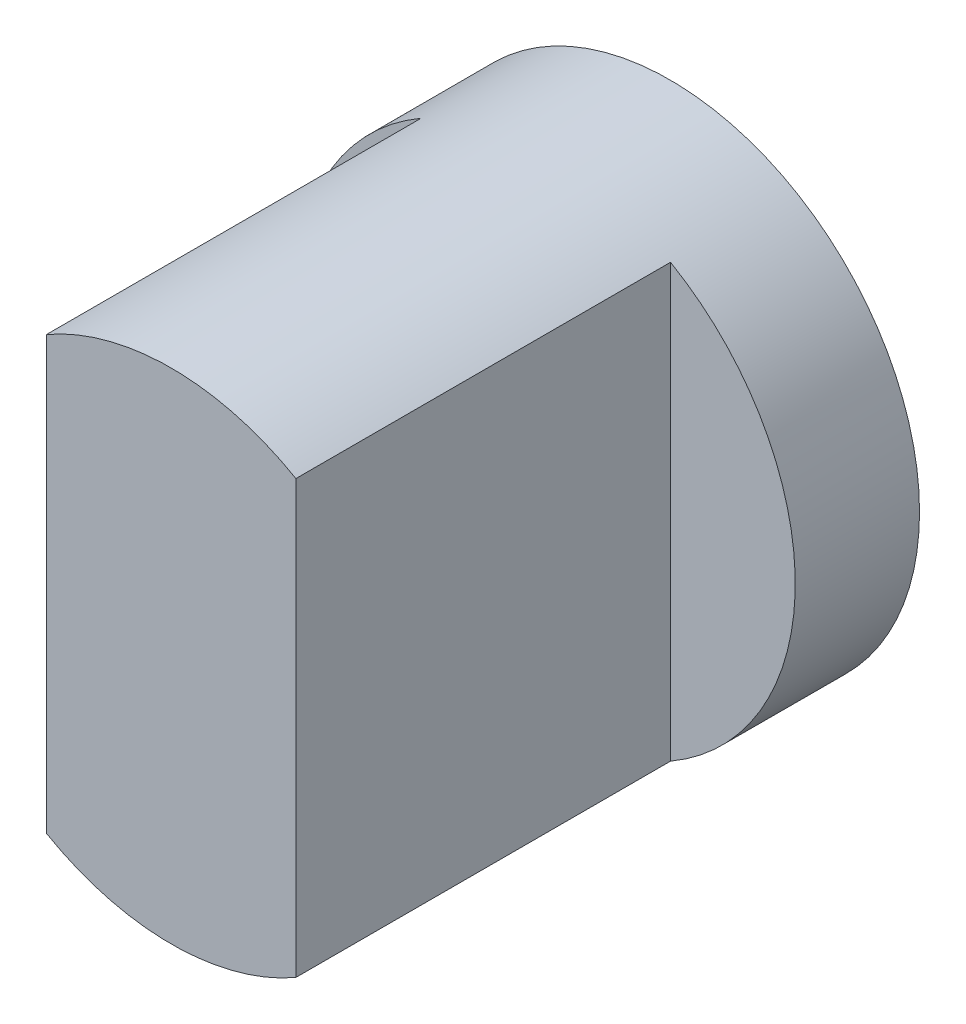
ISO-10303-21;
HEADER;
FILE_DESCRIPTION(('STEP AP214'),'2;1');
FILE_NAME('part.step','',(''),(''),'','','');
FILE_SCHEMA(('AUTOMOTIVE_DESIGN { 1 0 10303 214 1 1 1 1 }'));
ENDSEC;
DATA;
#1=APPLICATION_CONTEXT('core data for automotive mechanical design processes');
#2=APPLICATION_PROTOCOL_DEFINITION('international standard','automotive_design',2000,#1);
#3=PRODUCT_CONTEXT('',#1,'mechanical');
#4=PRODUCT('Part','Part','',(#3));
#5=PRODUCT_RELATED_PRODUCT_CATEGORY('part','',(#4));
#6=PRODUCT_DEFINITION_FORMATION('','',#4);
#7=PRODUCT_DEFINITION_CONTEXT('part definition',#1,'design');
#8=PRODUCT_DEFINITION('design','',#6,#7);
#9=PRODUCT_DEFINITION_SHAPE('','',#8);
#10=(LENGTH_UNIT() NAMED_UNIT(*) SI_UNIT(.MILLI.,.METRE.));
#11=(NAMED_UNIT(*) PLANE_ANGLE_UNIT() SI_UNIT($,.RADIAN.));
#12=(NAMED_UNIT(*) SI_UNIT($,.STERADIAN.) SOLID_ANGLE_UNIT());
#13=UNCERTAINTY_MEASURE_WITH_UNIT(LENGTH_MEASURE(1.E-05),#10,'distance_accuracy_value','');
#14=(GEOMETRIC_REPRESENTATION_CONTEXT(3) GLOBAL_UNCERTAINTY_ASSIGNED_CONTEXT((#13)) GLOBAL_UNIT_ASSIGNED_CONTEXT((#10,
#11,#12)) REPRESENTATION_CONTEXT('',''));
#15=CARTESIAN_POINT('',(0.,0.,0.));
#16=DIRECTION('',(0.,0.,1.));
#17=DIRECTION('',(1.,0.,0.));
#18=AXIS2_PLACEMENT_3D('',#15,#16,#17);
#19=CARTESIAN_POINT('',(0.,0.,4.));
#20=DIRECTION('',(0.,0.,-1.));
#21=DIRECTION('',(-1.,0.,0.));
#22=AXIS2_PLACEMENT_3D('',#19,#20,#21);
#23=CYLINDRICAL_SURFACE('',#22,2.);
#24=CARTESIAN_POINT('',(0.,0.,4.));
#25=DIRECTION('',(0.,0.,1.));
#26=DIRECTION('',(1.,0.,0.));
#27=AXIS2_PLACEMENT_3D('',#24,#25,#26);
#28=CIRCLE('',#27,2.);
#29=CARTESIAN_POINT('',(1.,1.73205080756888,4.));
#30=VERTEX_POINT('',#29);
#31=CARTESIAN_POINT('',(-1.,1.73205080756888,4.));
#32=VERTEX_POINT('',#31);
#33=EDGE_CURVE('E76',#30,#32,#28,.T.);
#34=ORIENTED_EDGE('',*,*,#33,.F.);
#35=DIRECTION('',(0.,0.,-1.));
#36=VECTOR('',#35,1.);
#37=CARTESIAN_POINT('',(1.,1.73205080756888,4.));
#38=LINE('',#37,#36);
#39=CARTESIAN_POINT('',(1.,1.73205080756888,0.996424706562642));
#40=VERTEX_POINT('',#39);
#41=EDGE_CURVE('E55',#30,#40,#38,.T.);
#42=ORIENTED_EDGE('',*,*,#41,.T.);
#43=CARTESIAN_POINT('',(0.,0.,0.996424706562642));
#44=DIRECTION('',(0.,0.,-1.));
#45=DIRECTION('',(-1.,0.,0.));
#46=AXIS2_PLACEMENT_3D('',#43,#44,#45);
#47=CIRCLE('',#46,2.);
#48=CARTESIAN_POINT('',(1.,-1.73205080756888,0.996424706562642));
#49=VERTEX_POINT('',#48);
#50=EDGE_CURVE('E11',#40,#49,#47,.T.);
#51=ORIENTED_EDGE('',*,*,#50,.T.);
#52=DIRECTION('',(0.,0.,-1.));
#53=VECTOR('',#52,1.);
#54=CARTESIAN_POINT('',(1.,-1.73205080756888,4.));
#55=LINE('',#54,#53);
#56=CARTESIAN_POINT('',(1.,-1.73205080756888,4.));
#57=VERTEX_POINT('',#56);
#58=EDGE_CURVE('E93',#49,#57,#55,.F.);
#59=ORIENTED_EDGE('',*,*,#58,.T.);
#60=CARTESIAN_POINT('',(-1.,-1.73205080756888,4.));
#61=VERTEX_POINT('',#60);
#62=EDGE_CURVE('E83',#61,#57,#28,.T.);
#63=ORIENTED_EDGE('',*,*,#62,.F.);
#64=DIRECTION('',(0.,0.,-1.));
#65=VECTOR('',#64,1.);
#66=CARTESIAN_POINT('',(-1.,-1.73205080756888,4.));
#67=LINE('',#66,#65);
#68=CARTESIAN_POINT('',(-1.,-1.73205080756888,0.996424706562642));
#69=VERTEX_POINT('',#68);
#70=EDGE_CURVE('E47',#61,#69,#67,.T.);
#71=ORIENTED_EDGE('',*,*,#70,.T.);
#72=CARTESIAN_POINT('',(0.,0.,0.996424706562642));
#73=DIRECTION('',(0.,0.,-1.));
#74=DIRECTION('',(-1.,0.,0.));
#75=AXIS2_PLACEMENT_3D('',#72,#73,#74);
#76=CIRCLE('',#75,2.);
#77=CARTESIAN_POINT('',(-1.,1.73205080756888,0.996424706562642));
#78=VERTEX_POINT('',#77);
#79=EDGE_CURVE('E40',#69,#78,#76,.T.);
#80=ORIENTED_EDGE('',*,*,#79,.T.);
#81=DIRECTION('',(0.,0.,-1.));
#82=VECTOR('',#81,1.);
#83=CARTESIAN_POINT('',(-1.,1.73205080756888,4.));
#84=LINE('',#83,#82);
#85=EDGE_CURVE('E86',#78,#32,#84,.F.);
#86=ORIENTED_EDGE('',*,*,#85,.T.);
#87=EDGE_LOOP('',(#34,#42,#51,#59,#63,#71,#80,#86));
#88=FACE_BOUND('',#87,.T.);
#89=CARTESIAN_POINT('',(0.,0.,0.));
#90=DIRECTION('',(0.,0.,1.));
#91=DIRECTION('',(1.,0.,0.));
#92=AXIS2_PLACEMENT_3D('',#89,#90,#91);
#93=CIRCLE('',#92,2.);
#94=CARTESIAN_POINT('',(2.,0.,0.));
#95=VERTEX_POINT('',#94);
#96=EDGE_CURVE('E101',#95,#95,#93,.T.);
#97=ORIENTED_EDGE('',*,*,#96,.T.);
#98=EDGE_LOOP('',(#97));
#99=FACE_BOUND('',#98,.T.);
#100=ADVANCED_FACE('F33',(#88,#99),#23,.T.);
#101=CARTESIAN_POINT('',(0.,0.,4.));
#102=DIRECTION('',(0.,0.,1.));
#103=DIRECTION('',(1.,0.,0.));
#104=AXIS2_PLACEMENT_3D('',#101,#102,#103);
#105=PLANE('',#104);
#106=DIRECTION('',(0.,-1.,0.));
#107=VECTOR('',#106,1.);
#108=CARTESIAN_POINT('',(1.,0.,4.));
#109=LINE('',#108,#107);
#110=EDGE_CURVE('E80',#30,#57,#109,.T.);
#111=ORIENTED_EDGE('',*,*,#110,.F.);
#112=ORIENTED_EDGE('',*,*,#33,.T.);
#113=DIRECTION('',(0.,1.,0.));
#114=VECTOR('',#113,1.);
#115=CARTESIAN_POINT('',(-1.,0.,4.));
#116=LINE('',#115,#114);
#117=EDGE_CURVE('E78',#61,#32,#116,.T.);
#118=ORIENTED_EDGE('',*,*,#117,.F.);
#119=ORIENTED_EDGE('',*,*,#62,.T.);
#120=EDGE_LOOP('',(#111,#112,#118,#119));
#121=FACE_BOUND('',#120,.T.);
#122=ADVANCED_FACE('F77',(#121),#105,.T.);
#123=CARTESIAN_POINT('',(0.,0.,0.));
#124=DIRECTION('',(0.,0.,1.));
#125=DIRECTION('',(1.,0.,0.));
#126=AXIS2_PLACEMENT_3D('',#123,#124,#125);
#127=PLANE('',#126);
#128=ORIENTED_EDGE('',*,*,#96,.F.);
#129=EDGE_LOOP('',(#128));
#130=FACE_BOUND('',#129,.T.);
#131=ADVANCED_FACE('F123',(#130),#127,.F.);
#132=CARTESIAN_POINT('',(-1.,-2.,3.));
#133=DIRECTION('',(1.,0.,0.));
#134=DIRECTION('',(0.,0.,-1.));
#135=AXIS2_PLACEMENT_3D('',#132,#133,#134);
#136=PLANE('',#135);
#137=ORIENTED_EDGE('',*,*,#117,.T.);
#138=ORIENTED_EDGE('',*,*,#85,.F.);
#139=DIRECTION('',(0.,1.,0.));
#140=VECTOR('',#139,1.);
#141=CARTESIAN_POINT('',(-1.,-2.,0.996424706562642));
#142=LINE('',#141,#140);
#143=EDGE_CURVE('E95',#69,#78,#142,.T.);
#144=ORIENTED_EDGE('',*,*,#143,.F.);
#145=ORIENTED_EDGE('',*,*,#70,.F.);
#146=EDGE_LOOP('',(#137,#138,#144,#145));
#147=FACE_BOUND('',#146,.T.);
#148=ADVANCED_FACE('F85',(#147),#136,.F.);
#149=CARTESIAN_POINT('',(-1.,-2.,0.996424706562642));
#150=DIRECTION('',(0.,0.,-1.));
#151=DIRECTION('',(-1.,0.,0.));
#152=AXIS2_PLACEMENT_3D('',#149,#150,#151);
#153=PLANE('',#152);
#154=ORIENTED_EDGE('',*,*,#79,.F.);
#155=ORIENTED_EDGE('',*,*,#143,.T.);
#156=EDGE_LOOP('',(#154,#155));
#157=FACE_BOUND('',#156,.T.);
#158=ADVANCED_FACE('F110',(#157),#153,.F.);
#159=CARTESIAN_POINT('',(1.,-2.,0.996424706562642));
#160=DIRECTION('',(0.,0.,-1.));
#161=DIRECTION('',(-1.,0.,0.));
#162=AXIS2_PLACEMENT_3D('',#159,#160,#161);
#163=PLANE('',#162);
#164=DIRECTION('',(0.,1.,0.));
#165=VECTOR('',#164,1.);
#166=CARTESIAN_POINT('',(1.,-2.,0.996424706562642));
#167=LINE('',#166,#165);
#168=EDGE_CURVE('E91',#49,#40,#167,.T.);
#169=ORIENTED_EDGE('',*,*,#168,.F.);
#170=ORIENTED_EDGE('',*,*,#50,.F.);
#171=EDGE_LOOP('',(#169,#170));
#172=FACE_BOUND('',#171,.T.);
#173=ADVANCED_FACE('F108',(#172),#163,.F.);
#174=CARTESIAN_POINT('',(1.,-2.,3.));
#175=DIRECTION('',(-1.,0.,0.));
#176=DIRECTION('',(0.,0.,1.));
#177=AXIS2_PLACEMENT_3D('',#174,#175,#176);
#178=PLANE('',#177);
#179=ORIENTED_EDGE('',*,*,#110,.T.);
#180=ORIENTED_EDGE('',*,*,#58,.F.);
#181=ORIENTED_EDGE('',*,*,#168,.T.);
#182=ORIENTED_EDGE('',*,*,#41,.F.);
#183=EDGE_LOOP('',(#179,#180,#181,#182));
#184=FACE_BOUND('',#183,.T.);
#185=ADVANCED_FACE('F105',(#184),#178,.F.);
#186=CLOSED_SHELL('',(#100,#122,#131,#148,#158,#173,#185));
#187=MANIFOLD_SOLID_BREP('B2',#186);
#188=ADVANCED_BREP_SHAPE_REPRESENTATION('',(#18,#187),#14);
#189=SHAPE_DEFINITION_REPRESENTATION(#9,#188);
ENDSEC;
END-ISO-10303-21;
